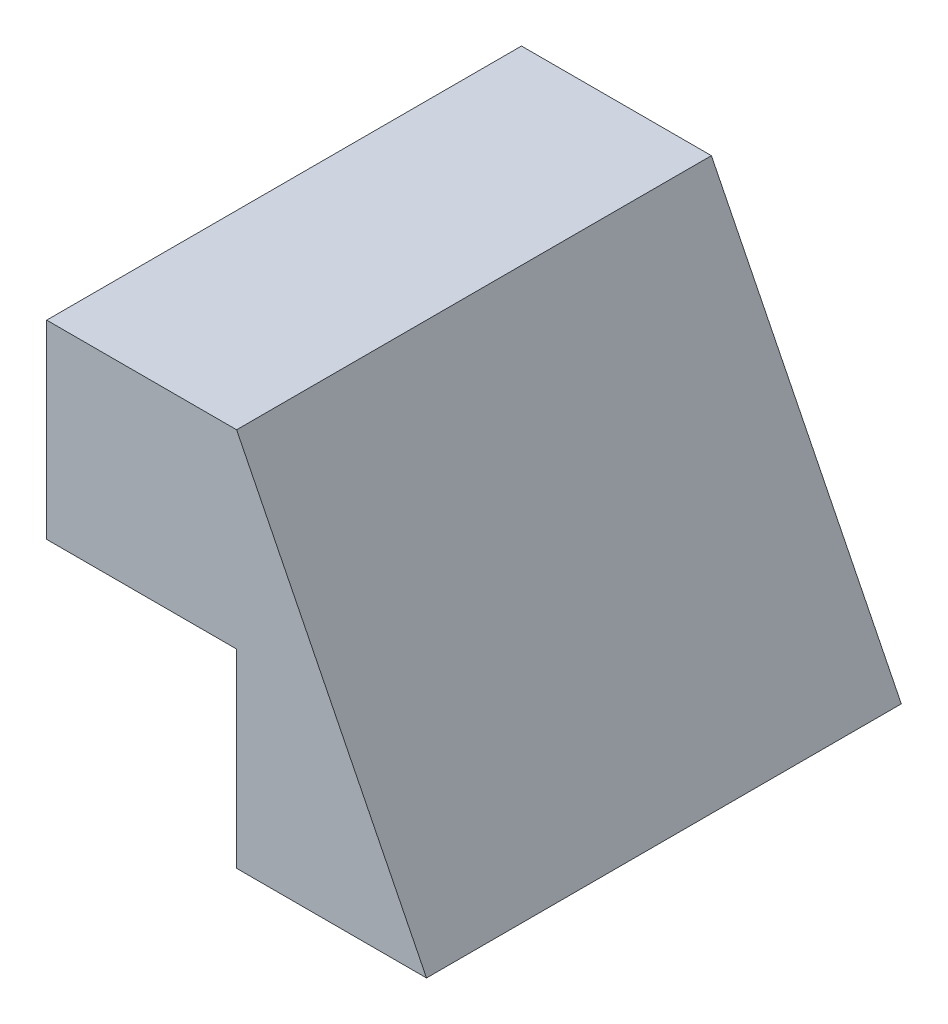
ISO-10303-21;
HEADER;
FILE_DESCRIPTION(('STEP AP214'),'2;1');
FILE_NAME('part.step','',(''),(''),'','','');
FILE_SCHEMA(('AUTOMOTIVE_DESIGN { 1 0 10303 214 1 1 1 1 }'));
ENDSEC;
DATA;
#1=APPLICATION_CONTEXT('core data for automotive mechanical design processes');
#2=APPLICATION_PROTOCOL_DEFINITION('international standard','automotive_design',2000,#1);
#3=PRODUCT_CONTEXT('',#1,'mechanical');
#4=PRODUCT('Part','Part','',(#3));
#5=PRODUCT_RELATED_PRODUCT_CATEGORY('part','',(#4));
#6=PRODUCT_DEFINITION_FORMATION('','',#4);
#7=PRODUCT_DEFINITION_CONTEXT('part definition',#1,'design');
#8=PRODUCT_DEFINITION('design','',#6,#7);
#9=PRODUCT_DEFINITION_SHAPE('','',#8);
#10=(LENGTH_UNIT() NAMED_UNIT(*) SI_UNIT(.MILLI.,.METRE.));
#11=(NAMED_UNIT(*) PLANE_ANGLE_UNIT() SI_UNIT($,.RADIAN.));
#12=(NAMED_UNIT(*) SI_UNIT($,.STERADIAN.) SOLID_ANGLE_UNIT());
#13=UNCERTAINTY_MEASURE_WITH_UNIT(LENGTH_MEASURE(1.E-05),#10,'distance_accuracy_value','');
#14=(GEOMETRIC_REPRESENTATION_CONTEXT(3) GLOBAL_UNCERTAINTY_ASSIGNED_CONTEXT((#13)) GLOBAL_UNIT_ASSIGNED_CONTEXT((#10,
#11,#12)) REPRESENTATION_CONTEXT('',''));
#15=CARTESIAN_POINT('',(0.,0.,0.));
#16=DIRECTION('',(0.,0.,1.));
#17=DIRECTION('',(1.,0.,0.));
#18=AXIS2_PLACEMENT_3D('',#15,#16,#17);
#19=CARTESIAN_POINT('',(-10.,10.,25.));
#20=DIRECTION('',(1.,0.,0.));
#21=DIRECTION('',(0.,0.,-1.));
#22=AXIS2_PLACEMENT_3D('',#19,#20,#21);
#23=PLANE('',#22);
#24=DIRECTION('',(0.,-1.,0.));
#25=VECTOR('',#24,1.);
#26=CARTESIAN_POINT('',(-10.,10.,0.));
#27=LINE('',#26,#25);
#28=CARTESIAN_POINT('',(-10.,20.,0.));
#29=VERTEX_POINT('',#28);
#30=CARTESIAN_POINT('',(-10.,10.,0.));
#31=VERTEX_POINT('',#30);
#32=EDGE_CURVE('E117',#29,#31,#27,.T.);
#33=ORIENTED_EDGE('',*,*,#32,.T.);
#34=DIRECTION('',(0.,0.,-1.));
#35=VECTOR('',#34,1.);
#36=CARTESIAN_POINT('',(-10.,10.,25.));
#37=LINE('',#36,#35);
#38=CARTESIAN_POINT('',(-10.,10.,25.));
#39=VERTEX_POINT('',#38);
#40=EDGE_CURVE('E11',#39,#31,#37,.T.);
#41=ORIENTED_EDGE('',*,*,#40,.F.);
#42=DIRECTION('',(0.,-1.,0.));
#43=VECTOR('',#42,1.);
#44=CARTESIAN_POINT('',(-10.,10.,25.));
#45=LINE('',#44,#43);
#46=CARTESIAN_POINT('',(-10.,20.,25.));
#47=VERTEX_POINT('',#46);
#48=EDGE_CURVE('E127',#47,#39,#45,.T.);
#49=ORIENTED_EDGE('',*,*,#48,.F.);
#50=DIRECTION('',(0.,0.,-1.));
#51=VECTOR('',#50,1.);
#52=CARTESIAN_POINT('',(-10.,20.,25.));
#53=LINE('',#52,#51);
#54=EDGE_CURVE('E113',#47,#29,#53,.T.);
#55=ORIENTED_EDGE('',*,*,#54,.T.);
#56=EDGE_LOOP('',(#33,#41,#49,#55));
#57=FACE_BOUND('',#56,.T.);
#58=ADVANCED_FACE('F33',(#57),#23,.F.);
#59=CARTESIAN_POINT('',(0.,10.,25.));
#60=DIRECTION('',(0.,1.,0.));
#61=DIRECTION('',(-1.,0.,0.));
#62=AXIS2_PLACEMENT_3D('',#59,#60,#61);
#63=PLANE('',#62);
#64=DIRECTION('',(1.,0.,0.));
#65=VECTOR('',#64,1.);
#66=CARTESIAN_POINT('',(0.,10.,0.));
#67=LINE('',#66,#65);
#68=CARTESIAN_POINT('',(0.,10.,0.));
#69=VERTEX_POINT('',#68);
#70=EDGE_CURVE('E120',#31,#69,#67,.T.);
#71=ORIENTED_EDGE('',*,*,#70,.T.);
#72=DIRECTION('',(0.,0.,-1.));
#73=VECTOR('',#72,1.);
#74=CARTESIAN_POINT('',(0.,10.,25.));
#75=LINE('',#74,#73);
#76=CARTESIAN_POINT('',(0.,10.,25.));
#77=VERTEX_POINT('',#76);
#78=EDGE_CURVE('E41',#77,#69,#75,.T.);
#79=ORIENTED_EDGE('',*,*,#78,.F.);
#80=DIRECTION('',(1.,0.,0.));
#81=VECTOR('',#80,1.);
#82=CARTESIAN_POINT('',(0.,10.,25.));
#83=LINE('',#82,#81);
#84=EDGE_CURVE('E86',#39,#77,#83,.T.);
#85=ORIENTED_EDGE('',*,*,#84,.F.);
#86=ORIENTED_EDGE('',*,*,#40,.T.);
#87=EDGE_LOOP('',(#71,#79,#85,#86));
#88=FACE_BOUND('',#87,.T.);
#89=ADVANCED_FACE('F151',(#88),#63,.F.);
#90=CARTESIAN_POINT('',(0.,0.,25.));
#91=DIRECTION('',(1.,0.,0.));
#92=DIRECTION('',(0.,0.,-1.));
#93=AXIS2_PLACEMENT_3D('',#90,#91,#92);
#94=PLANE('',#93);
#95=DIRECTION('',(0.,-1.,0.));
#96=VECTOR('',#95,1.);
#97=CARTESIAN_POINT('',(0.,0.,0.));
#98=LINE('',#97,#96);
#99=CARTESIAN_POINT('',(0.,0.,0.));
#100=VERTEX_POINT('',#99);
#101=EDGE_CURVE('E122',#69,#100,#98,.T.);
#102=ORIENTED_EDGE('',*,*,#101,.T.);
#103=DIRECTION('',(0.,0.,-1.));
#104=VECTOR('',#103,1.);
#105=CARTESIAN_POINT('',(0.,0.,25.));
#106=LINE('',#105,#104);
#107=CARTESIAN_POINT('',(0.,0.,25.));
#108=VERTEX_POINT('',#107);
#109=EDGE_CURVE('E108',#108,#100,#106,.T.);
#110=ORIENTED_EDGE('',*,*,#109,.F.);
#111=DIRECTION('',(0.,-1.,0.));
#112=VECTOR('',#111,1.);
#113=CARTESIAN_POINT('',(0.,0.,25.));
#114=LINE('',#113,#112);
#115=EDGE_CURVE('E99',#77,#108,#114,.T.);
#116=ORIENTED_EDGE('',*,*,#115,.F.);
#117=ORIENTED_EDGE('',*,*,#78,.T.);
#118=EDGE_LOOP('',(#102,#110,#116,#117));
#119=FACE_BOUND('',#118,.T.);
#120=ADVANCED_FACE('F133',(#119),#94,.F.);
#121=CARTESIAN_POINT('',(10.,0.,25.));
#122=DIRECTION('',(0.,1.,0.));
#123=DIRECTION('',(-1.,0.,0.));
#124=AXIS2_PLACEMENT_3D('',#121,#122,#123);
#125=PLANE('',#124);
#126=DIRECTION('',(1.,0.,0.));
#127=VECTOR('',#126,1.);
#128=CARTESIAN_POINT('',(10.,0.,0.));
#129=LINE('',#128,#127);
#130=CARTESIAN_POINT('',(10.,0.,0.));
#131=VERTEX_POINT('',#130);
#132=EDGE_CURVE('E107',#100,#131,#129,.T.);
#133=ORIENTED_EDGE('',*,*,#132,.T.);
#134=DIRECTION('',(0.,0.,-1.));
#135=VECTOR('',#134,1.);
#136=CARTESIAN_POINT('',(10.,0.,25.));
#137=LINE('',#136,#135);
#138=CARTESIAN_POINT('',(10.,0.,25.));
#139=VERTEX_POINT('',#138);
#140=EDGE_CURVE('E104',#139,#131,#137,.T.);
#141=ORIENTED_EDGE('',*,*,#140,.F.);
#142=DIRECTION('',(1.,0.,0.));
#143=VECTOR('',#142,1.);
#144=CARTESIAN_POINT('',(10.,0.,25.));
#145=LINE('',#144,#143);
#146=EDGE_CURVE('E93',#108,#139,#145,.T.);
#147=ORIENTED_EDGE('',*,*,#146,.F.);
#148=ORIENTED_EDGE('',*,*,#109,.T.);
#149=EDGE_LOOP('',(#133,#141,#147,#148));
#150=FACE_BOUND('',#149,.T.);
#151=ADVANCED_FACE('F105',(#150),#125,.F.);
#152=CARTESIAN_POINT('',(0.,20.,25.));
#153=DIRECTION('',(-0.894427190999916,-0.447213595499958,0.));
#154=DIRECTION('',(0.447213595499958,-0.894427190999916,0.));
#155=AXIS2_PLACEMENT_3D('',#152,#153,#154);
#156=PLANE('',#155);
#157=DIRECTION('',(-0.447213595499958,0.894427190999916,0.));
#158=VECTOR('',#157,1.);
#159=CARTESIAN_POINT('',(0.,20.,0.));
#160=LINE('',#159,#158);
#161=CARTESIAN_POINT('',(0.,20.,0.));
#162=VERTEX_POINT('',#161);
#163=EDGE_CURVE('E72',#131,#162,#160,.T.);
#164=ORIENTED_EDGE('',*,*,#163,.T.);
#165=DIRECTION('',(0.,0.,-1.));
#166=VECTOR('',#165,1.);
#167=CARTESIAN_POINT('',(0.,20.,25.));
#168=LINE('',#167,#166);
#169=CARTESIAN_POINT('',(0.,20.,25.));
#170=VERTEX_POINT('',#169);
#171=EDGE_CURVE('E109',#170,#162,#168,.T.);
#172=ORIENTED_EDGE('',*,*,#171,.F.);
#173=DIRECTION('',(-0.447213595499958,0.894427190999916,0.));
#174=VECTOR('',#173,1.);
#175=CARTESIAN_POINT('',(0.,20.,25.));
#176=LINE('',#175,#174);
#177=EDGE_CURVE('E97',#139,#170,#176,.T.);
#178=ORIENTED_EDGE('',*,*,#177,.F.);
#179=ORIENTED_EDGE('',*,*,#140,.T.);
#180=EDGE_LOOP('',(#164,#172,#178,#179));
#181=FACE_BOUND('',#180,.T.);
#182=ADVANCED_FACE('F111',(#181),#156,.F.);
#183=CARTESIAN_POINT('',(-10.,20.,25.));
#184=DIRECTION('',(0.,-1.,0.));
#185=DIRECTION('',(0.,0.,-1.));
#186=AXIS2_PLACEMENT_3D('',#183,#184,#185);
#187=PLANE('',#186);
#188=DIRECTION('',(-1.,0.,0.));
#189=VECTOR('',#188,1.);
#190=CARTESIAN_POINT('',(-10.,20.,0.));
#191=LINE('',#190,#189);
#192=EDGE_CURVE('E78',#162,#29,#191,.T.);
#193=ORIENTED_EDGE('',*,*,#192,.T.);
#194=ORIENTED_EDGE('',*,*,#54,.F.);
#195=DIRECTION('',(-1.,0.,0.));
#196=VECTOR('',#195,1.);
#197=CARTESIAN_POINT('',(-10.,20.,25.));
#198=LINE('',#197,#196);
#199=EDGE_CURVE('E49',#170,#47,#198,.T.);
#200=ORIENTED_EDGE('',*,*,#199,.F.);
#201=ORIENTED_EDGE('',*,*,#171,.T.);
#202=EDGE_LOOP('',(#193,#194,#200,#201));
#203=FACE_BOUND('',#202,.T.);
#204=ADVANCED_FACE('F140',(#203),#187,.F.);
#205=CARTESIAN_POINT('',(0.,0.,25.));
#206=DIRECTION('',(0.,0.,-1.));
#207=DIRECTION('',(-1.,0.,0.));
#208=AXIS2_PLACEMENT_3D('',#205,#206,#207);
#209=PLANE('',#208);
#210=ORIENTED_EDGE('',*,*,#48,.T.);
#211=ORIENTED_EDGE('',*,*,#84,.T.);
#212=ORIENTED_EDGE('',*,*,#115,.T.);
#213=ORIENTED_EDGE('',*,*,#146,.T.);
#214=ORIENTED_EDGE('',*,*,#177,.T.);
#215=ORIENTED_EDGE('',*,*,#199,.T.);
#216=EDGE_LOOP('',(#210,#211,#212,#213,#214,#215));
#217=FACE_BOUND('',#216,.T.);
#218=ADVANCED_FACE('F95',(#217),#209,.F.);
#219=CARTESIAN_POINT('',(0.,0.,0.));
#220=DIRECTION('',(0.,0.,-1.));
#221=DIRECTION('',(-1.,0.,0.));
#222=AXIS2_PLACEMENT_3D('',#219,#220,#221);
#223=PLANE('',#222);
#224=ORIENTED_EDGE('',*,*,#32,.F.);
#225=ORIENTED_EDGE('',*,*,#192,.F.);
#226=ORIENTED_EDGE('',*,*,#163,.F.);
#227=ORIENTED_EDGE('',*,*,#132,.F.);
#228=ORIENTED_EDGE('',*,*,#101,.F.);
#229=ORIENTED_EDGE('',*,*,#70,.F.);
#230=EDGE_LOOP('',(#224,#225,#226,#227,#228,#229));
#231=FACE_BOUND('',#230,.T.);
#232=ADVANCED_FACE('F136',(#231),#223,.T.);
#233=CLOSED_SHELL('',(#58,#89,#120,#151,#182,#204,#218,#232));
#234=MANIFOLD_SOLID_BREP('B2',#233);
#235=ADVANCED_BREP_SHAPE_REPRESENTATION('',(#18,#234),#14);
#236=SHAPE_DEFINITION_REPRESENTATION(#9,#235);
ENDSEC;
END-ISO-10303-21;
